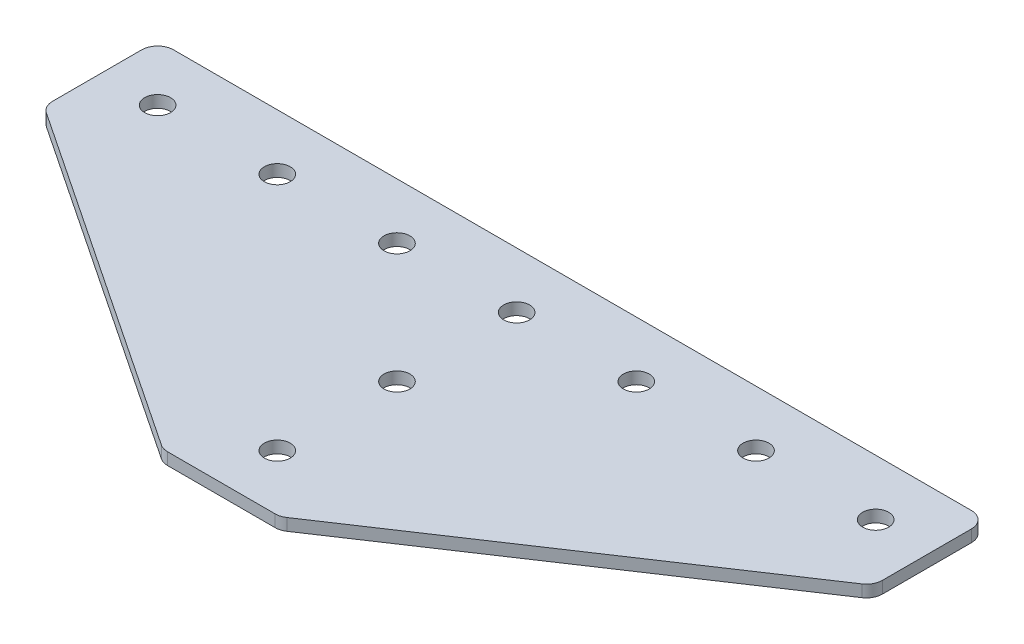
ISO-10303-21;
HEADER;
FILE_DESCRIPTION(('STEP AP214'),'2;1');
FILE_NAME('part.step','',(''),(''),'','','');
FILE_SCHEMA(('AUTOMOTIVE_DESIGN { 1 0 10303 214 1 1 1 1 }'));
ENDSEC;
DATA;
#1=APPLICATION_CONTEXT('core data for automotive mechanical design processes');
#2=APPLICATION_PROTOCOL_DEFINITION('international standard','automotive_design',2000,#1);
#3=PRODUCT_CONTEXT('',#1,'mechanical');
#4=PRODUCT('Part','Part','',(#3));
#5=PRODUCT_RELATED_PRODUCT_CATEGORY('part','',(#4));
#6=PRODUCT_DEFINITION_FORMATION('','',#4);
#7=PRODUCT_DEFINITION_CONTEXT('part definition',#1,'design');
#8=PRODUCT_DEFINITION('design','',#6,#7);
#9=PRODUCT_DEFINITION_SHAPE('','',#8);
#10=(LENGTH_UNIT() NAMED_UNIT(*) SI_UNIT(.MILLI.,.METRE.));
#11=(NAMED_UNIT(*) PLANE_ANGLE_UNIT() SI_UNIT($,.RADIAN.));
#12=(NAMED_UNIT(*) SI_UNIT($,.STERADIAN.) SOLID_ANGLE_UNIT());
#13=UNCERTAINTY_MEASURE_WITH_UNIT(LENGTH_MEASURE(1.E-05),#10,'distance_accuracy_value','');
#14=(GEOMETRIC_REPRESENTATION_CONTEXT(3) GLOBAL_UNCERTAINTY_ASSIGNED_CONTEXT((#13)) GLOBAL_UNIT_ASSIGNED_CONTEXT((#10,
#11,#12)) REPRESENTATION_CONTEXT('',''));
#15=CARTESIAN_POINT('',(0.,0.,0.));
#16=DIRECTION('',(0.,0.,1.));
#17=DIRECTION('',(1.,0.,0.));
#18=AXIS2_PLACEMENT_3D('',#15,#16,#17);
#19=CARTESIAN_POINT('',(-1.48251179552972,2.39126526075142,-16.6582429630034));
#20=DIRECTION('',(0.,-1.,0.));
#21=DIRECTION('',(0.,0.,-1.));
#22=AXIS2_PLACEMENT_3D('',#19,#20,#21);
#23=PLANE('',#22);
#24=CARTESIAN_POINT('',(-1.48251179552972,2.39126526075142,-16.6582429630034));
#25=DIRECTION('',(0.,1.,0.));
#26=DIRECTION('',(0.,0.,1.));
#27=AXIS2_PLACEMENT_3D('',#24,#25,#26);
#28=CIRCLE('',#27,1.625);
#29=CARTESIAN_POINT('',(-1.48251179552972,2.39126526075142,-15.0332429630034));
#30=VERTEX_POINT('',#29);
#31=EDGE_CURVE('E171',#30,#30,#28,.T.);
#32=ORIENTED_EDGE('',*,*,#31,.T.);
#33=EDGE_LOOP('',(#32));
#34=FACE_BOUND('',#33,.T.);
#35=DIRECTION('',(1.,0.,0.));
#36=VECTOR('',#35,1.);
#37=CARTESIAN_POINT('',(-8.48251179552981,2.39126526075142,20.3417570369966));
#38=LINE('',#37,#36);
#39=CARTESIAN_POINT('',(-8.22557270119984,2.39126526075142,20.3417570369966));
#40=VERTEX_POINT('',#39);
#41=CARTESIAN_POINT('',(5.26054911014039,2.39126526075142,20.3417570369966));
#42=VERTEX_POINT('',#41);
#43=EDGE_CURVE('E180',#40,#42,#38,.T.);
#44=ORIENTED_EDGE('',*,*,#43,.F.);
#45=CARTESIAN_POINT('',(-8.22557270119984,2.39126526075142,18.3417570369966));
#46=DIRECTION('',(0.,-1.,0.));
#47=DIRECTION('',(0.,0.,-1.));
#48=AXIS2_PLACEMENT_3D('',#45,#46,#47);
#49=CIRCLE('',#48,2.);
#50=CARTESIAN_POINT('',(-9.3349730936503,2.39126526075142,20.0058576256723));
#51=VERTEX_POINT('',#50);
#52=EDGE_CURVE('E224',#40,#51,#49,.T.);
#53=ORIENTED_EDGE('',*,*,#52,.T.);
#54=DIRECTION('',(-0.832050294337843,0.,-0.55470019622523));
#55=VECTOR('',#54,1.);
#56=CARTESIAN_POINT('',(-8.8311239766638,2.39126526075142,20.3417570369966));
#57=LINE('',#56,#55);
#58=CARTESIAN_POINT('',(-52.5919121879801,2.39126526075142,-8.83210177054765));
#59=VERTEX_POINT('',#58);
#60=EDGE_CURVE('E132',#51,#59,#57,.T.);
#61=ORIENTED_EDGE('',*,*,#60,.T.);
#62=CARTESIAN_POINT('',(-51.4825117955296,2.39126526075142,-10.4962023592233));
#63=DIRECTION('',(0.,-1.,0.));
#64=DIRECTION('',(0.,0.,-1.));
#65=AXIS2_PLACEMENT_3D('',#62,#63,#64);
#66=CIRCLE('',#65,2.);
#67=CARTESIAN_POINT('',(-53.4825117955296,2.39126526075142,-10.4962023592233));
#68=VERTEX_POINT('',#67);
#69=EDGE_CURVE('E198',#59,#68,#66,.T.);
#70=ORIENTED_EDGE('',*,*,#69,.T.);
#71=DIRECTION('',(0.,0.,-1.));
#72=VECTOR('',#71,1.);
#73=CARTESIAN_POINT('',(-53.4825117955296,2.39126526075142,-9.42583484224735));
#74=LINE('',#73,#72);
#75=CARTESIAN_POINT('',(-53.4825117955296,2.39126526075142,-21.6582429630034));
#76=VERTEX_POINT('',#75);
#77=EDGE_CURVE('E125',#68,#76,#74,.T.);
#78=ORIENTED_EDGE('',*,*,#77,.T.);
#79=CARTESIAN_POINT('',(-51.4825117955296,2.39126526075142,-21.6582429630034));
#80=DIRECTION('',(0.,-1.,0.));
#81=DIRECTION('',(0.,0.,-1.));
#82=AXIS2_PLACEMENT_3D('',#79,#80,#81);
#83=CIRCLE('',#82,2.);
#84=CARTESIAN_POINT('',(-51.4825117955296,2.39126526075142,-23.6582429630034));
#85=VERTEX_POINT('',#84);
#86=EDGE_CURVE('E217',#76,#85,#83,.T.);
#87=ORIENTED_EDGE('',*,*,#86,.T.);
#88=DIRECTION('',(-1.,0.,0.));
#89=VECTOR('',#88,1.);
#90=CARTESIAN_POINT('',(50.5174882044702,2.39126526075142,-23.6582429630034));
#91=LINE('',#90,#89);
#92=CARTESIAN_POINT('',(48.5174882044702,2.39126526075142,-23.6582429630034));
#93=VERTEX_POINT('',#92);
#94=EDGE_CURVE('E177',#93,#85,#91,.T.);
#95=ORIENTED_EDGE('',*,*,#94,.F.);
#96=CARTESIAN_POINT('',(48.5174882044702,2.39126526075142,-21.6582429630034));
#97=DIRECTION('',(0.,-1.,0.));
#98=DIRECTION('',(0.,0.,-1.));
#99=AXIS2_PLACEMENT_3D('',#96,#97,#98);
#100=CIRCLE('',#99,2.);
#101=CARTESIAN_POINT('',(50.5174882044702,2.39126526075142,-21.6582429630034));
#102=VERTEX_POINT('',#101);
#103=EDGE_CURVE('E219',#93,#102,#100,.T.);
#104=ORIENTED_EDGE('',*,*,#103,.T.);
#105=DIRECTION('',(0.,0.,-1.));
#106=VECTOR('',#105,1.);
#107=CARTESIAN_POINT('',(50.5174882044702,2.39126526075142,-9.42583484224737));
#108=LINE('',#107,#106);
#109=CARTESIAN_POINT('',(50.5174882044702,2.39126526075142,-10.4962023592234));
#110=VERTEX_POINT('',#109);
#111=EDGE_CURVE('E126',#110,#102,#108,.T.);
#112=ORIENTED_EDGE('',*,*,#111,.F.);
#113=CARTESIAN_POINT('',(48.5174882044702,2.39126526075142,-10.4962023592234));
#114=DIRECTION('',(0.,-1.,0.));
#115=DIRECTION('',(0.,0.,-1.));
#116=AXIS2_PLACEMENT_3D('',#113,#114,#115);
#117=CIRCLE('',#116,2.);
#118=CARTESIAN_POINT('',(49.6268885969206,2.39126526075142,-8.83210177054766));
#119=VERTEX_POINT('',#118);
#120=EDGE_CURVE('E31',#110,#119,#117,.T.);
#121=ORIENTED_EDGE('',*,*,#120,.T.);
#122=DIRECTION('',(0.832050294337843,0.,-0.55470019622523));
#123=VECTOR('',#122,1.);
#124=CARTESIAN_POINT('',(5.86610038560438,2.39126526075142,20.3417570369966));
#125=LINE('',#124,#123);
#126=CARTESIAN_POINT('',(6.36994950259085,2.39126526075142,20.0058576256723));
#127=VERTEX_POINT('',#126);
#128=EDGE_CURVE('E184',#127,#119,#125,.T.);
#129=ORIENTED_EDGE('',*,*,#128,.F.);
#130=CARTESIAN_POINT('',(5.26054911014039,2.39126526075142,18.3417570369966));
#131=DIRECTION('',(0.,-1.,0.));
#132=DIRECTION('',(0.,0.,-1.));
#133=AXIS2_PLACEMENT_3D('',#130,#131,#132);
#134=CIRCLE('',#133,2.);
#135=EDGE_CURVE('E222',#127,#42,#134,.T.);
#136=ORIENTED_EDGE('',*,*,#135,.T.);
#137=EDGE_LOOP('',(#44,#53,#61,#70,#78,#87,#95,#104,#112,#121,#129,#136));
#138=FACE_BOUND('',#137,.T.);
#139=CARTESIAN_POINT('',(-1.48251179552973,2.39126526075142,13.3417570369966));
#140=DIRECTION('',(0.,1.,0.));
#141=DIRECTION('',(0.,0.,1.));
#142=AXIS2_PLACEMENT_3D('',#139,#140,#141);
#143=CIRCLE('',#142,1.625);
#144=CARTESIAN_POINT('',(-1.48251179552973,2.39126526075142,14.9667570369966));
#145=VERTEX_POINT('',#144);
#146=EDGE_CURVE('E153',#145,#145,#143,.T.);
#147=ORIENTED_EDGE('',*,*,#146,.T.);
#148=EDGE_LOOP('',(#147));
#149=FACE_BOUND('',#148,.T.);
#150=CARTESIAN_POINT('',(-1.48251179552973,2.39126526075142,-1.6582429630034));
#151=DIRECTION('',(0.,1.,0.));
#152=DIRECTION('',(0.,0.,1.));
#153=AXIS2_PLACEMENT_3D('',#150,#151,#152);
#154=CIRCLE('',#153,1.625);
#155=CARTESIAN_POINT('',(-1.48251179552973,2.39126526075142,-0.0332429630033966));
#156=VERTEX_POINT('',#155);
#157=EDGE_CURVE('E159',#156,#156,#154,.T.);
#158=ORIENTED_EDGE('',*,*,#157,.T.);
#159=EDGE_LOOP('',(#158));
#160=FACE_BOUND('',#159,.T.);
#161=CARTESIAN_POINT('',(43.5174882044703,2.39126526075142,-16.6582429630034));
#162=DIRECTION('',(0.,1.,0.));
#163=DIRECTION('',(0.,0.,1.));
#164=AXIS2_PLACEMENT_3D('',#161,#162,#163);
#165=CIRCLE('',#164,1.625);
#166=CARTESIAN_POINT('',(43.5174882044703,2.39126526075142,-15.0332429630034));
#167=VERTEX_POINT('',#166);
#168=EDGE_CURVE('E140',#167,#167,#165,.T.);
#169=ORIENTED_EDGE('',*,*,#168,.T.);
#170=EDGE_LOOP('',(#169));
#171=FACE_BOUND('',#170,.T.);
#172=CARTESIAN_POINT('',(28.5174882044703,2.39126526075142,-16.6582429630034));
#173=DIRECTION('',(0.,1.,0.));
#174=DIRECTION('',(0.,0.,1.));
#175=AXIS2_PLACEMENT_3D('',#172,#173,#174);
#176=CIRCLE('',#175,1.625);
#177=CARTESIAN_POINT('',(28.5174882044703,2.39126526075142,-15.0332429630034));
#178=VERTEX_POINT('',#177);
#179=EDGE_CURVE('E147',#178,#178,#176,.T.);
#180=ORIENTED_EDGE('',*,*,#179,.T.);
#181=EDGE_LOOP('',(#180));
#182=FACE_BOUND('',#181,.T.);
#183=CARTESIAN_POINT('',(13.5174882044703,2.39126526075142,-16.6582429630034));
#184=DIRECTION('',(0.,1.,0.));
#185=DIRECTION('',(0.,0.,1.));
#186=AXIS2_PLACEMENT_3D('',#183,#184,#185);
#187=CIRCLE('',#186,1.625);
#188=CARTESIAN_POINT('',(13.5174882044703,2.39126526075142,-15.0332429630034));
#189=VERTEX_POINT('',#188);
#190=EDGE_CURVE('E165',#189,#189,#187,.T.);
#191=ORIENTED_EDGE('',*,*,#190,.T.);
#192=EDGE_LOOP('',(#191));
#193=FACE_BOUND('',#192,.T.);
#194=CARTESIAN_POINT('',(-46.4825117955297,2.39126526075142,-16.6582429630034));
#195=DIRECTION('',(0.,-1.,0.));
#196=DIRECTION('',(0.,0.,1.));
#197=AXIS2_PLACEMENT_3D('',#194,#195,#196);
#198=CIRCLE('',#197,1.625);
#199=CARTESIAN_POINT('',(-46.4825117955297,2.39126526075142,-15.0332429630034));
#200=VERTEX_POINT('',#199);
#201=EDGE_CURVE('E513',#200,#200,#198,.T.);
#202=ORIENTED_EDGE('',*,*,#201,.F.);
#203=EDGE_LOOP('',(#202));
#204=FACE_BOUND('',#203,.T.);
#205=CARTESIAN_POINT('',(-31.4825117955297,2.39126526075142,-16.6582429630034));
#206=DIRECTION('',(0.,-1.,0.));
#207=DIRECTION('',(0.,0.,1.));
#208=AXIS2_PLACEMENT_3D('',#205,#206,#207);
#209=CIRCLE('',#208,1.625);
#210=CARTESIAN_POINT('',(-31.4825117955297,2.39126526075142,-15.0332429630034));
#211=VERTEX_POINT('',#210);
#212=EDGE_CURVE('E506',#211,#211,#209,.T.);
#213=ORIENTED_EDGE('',*,*,#212,.F.);
#214=EDGE_LOOP('',(#213));
#215=FACE_BOUND('',#214,.T.);
#216=CARTESIAN_POINT('',(-16.4825117955297,2.39126526075142,-16.6582429630034));
#217=DIRECTION('',(0.,-1.,0.));
#218=DIRECTION('',(0.,0.,1.));
#219=AXIS2_PLACEMENT_3D('',#216,#217,#218);
#220=CIRCLE('',#219,1.625);
#221=CARTESIAN_POINT('',(-16.4825117955297,2.39126526075142,-15.0332429630034));
#222=VERTEX_POINT('',#221);
#223=EDGE_CURVE('E136',#222,#222,#220,.T.);
#224=ORIENTED_EDGE('',*,*,#223,.F.);
#225=EDGE_LOOP('',(#224));
#226=FACE_BOUND('',#225,.T.);
#227=ADVANCED_FACE('F16',(#34,#138,#149,#160,#171,#182,#193,#204,#215,#226),#23,.T.);
#228=CARTESIAN_POINT('',(50.5174882044702,2.39126526075142,-23.6582429630034));
#229=DIRECTION('',(0.,0.,-1.));
#230=DIRECTION('',(-1.,0.,0.));
#231=AXIS2_PLACEMENT_3D('',#228,#229,#230);
#232=PLANE('',#231);
#233=DIRECTION('',(-1.,0.,0.));
#234=VECTOR('',#233,1.);
#235=CARTESIAN_POINT('',(50.5174882044702,3.89126526075143,-23.6582429630034));
#236=LINE('',#235,#234);
#237=CARTESIAN_POINT('',(48.5174882044702,3.89126526075143,-23.6582429630034));
#238=VERTEX_POINT('',#237);
#239=CARTESIAN_POINT('',(-51.4825117955296,3.89126526075143,-23.6582429630034));
#240=VERTEX_POINT('',#239);
#241=EDGE_CURVE('E174',#238,#240,#236,.T.);
#242=ORIENTED_EDGE('',*,*,#241,.F.);
#243=DIRECTION('',(0.,1.,0.));
#244=VECTOR('',#243,1.);
#245=CARTESIAN_POINT('',(48.5174882044702,2.39126526075142,-23.6582429630034));
#246=LINE('',#245,#244);
#247=EDGE_CURVE('E24',#238,#93,#246,.F.);
#248=ORIENTED_EDGE('',*,*,#247,.T.);
#249=ORIENTED_EDGE('',*,*,#94,.T.);
#250=DIRECTION('',(0.,1.,0.));
#251=VECTOR('',#250,1.);
#252=CARTESIAN_POINT('',(-51.4825117955296,2.39126526075142,-23.6582429630034));
#253=LINE('',#252,#251);
#254=EDGE_CURVE('E235',#85,#240,#253,.T.);
#255=ORIENTED_EDGE('',*,*,#254,.T.);
#256=EDGE_LOOP('',(#242,#248,#249,#255));
#257=FACE_BOUND('',#256,.T.);
#258=ADVANCED_FACE('F241',(#257),#232,.T.);
#259=CARTESIAN_POINT('',(50.5174882044702,2.39126526075142,-9.42583484224737));
#260=DIRECTION('',(1.,0.,0.));
#261=DIRECTION('',(0.,0.,-1.));
#262=AXIS2_PLACEMENT_3D('',#259,#260,#261);
#263=PLANE('',#262);
#264=DIRECTION('',(0.,0.,-1.));
#265=VECTOR('',#264,1.);
#266=CARTESIAN_POINT('',(50.5174882044702,3.89126526075143,-9.42583484224737));
#267=LINE('',#266,#265);
#268=CARTESIAN_POINT('',(50.5174882044702,3.89126526075143,-10.4962023592234));
#269=VERTEX_POINT('',#268);
#270=CARTESIAN_POINT('',(50.5174882044702,3.89126526075143,-21.6582429630034));
#271=VERTEX_POINT('',#270);
#272=EDGE_CURVE('E181',#269,#271,#267,.T.);
#273=ORIENTED_EDGE('',*,*,#272,.F.);
#274=DIRECTION('',(0.,1.,0.));
#275=VECTOR('',#274,1.);
#276=CARTESIAN_POINT('',(50.5174882044702,2.39126526075142,-10.4962023592234));
#277=LINE('',#276,#275);
#278=EDGE_CURVE('E233',#269,#110,#277,.F.);
#279=ORIENTED_EDGE('',*,*,#278,.T.);
#280=ORIENTED_EDGE('',*,*,#111,.T.);
#281=DIRECTION('',(0.,1.,0.));
#282=VECTOR('',#281,1.);
#283=CARTESIAN_POINT('',(50.5174882044702,2.39126526075142,-21.6582429630034));
#284=LINE('',#283,#282);
#285=EDGE_CURVE('E230',#102,#271,#284,.T.);
#286=ORIENTED_EDGE('',*,*,#285,.T.);
#287=EDGE_LOOP('',(#273,#279,#280,#286));
#288=FACE_BOUND('',#287,.T.);
#289=ADVANCED_FACE('F252',(#288),#263,.T.);
#290=CARTESIAN_POINT('',(5.86610038560438,2.39126526075142,20.3417570369966));
#291=DIRECTION('',(0.55470019622523,0.,0.832050294337843));
#292=DIRECTION('',(0.832050294337843,0.,-0.55470019622523));
#293=AXIS2_PLACEMENT_3D('',#290,#291,#292);
#294=PLANE('',#293);
#295=DIRECTION('',(0.832050294337843,0.,-0.55470019622523));
#296=VECTOR('',#295,1.);
#297=CARTESIAN_POINT('',(5.86610038560438,3.89126526075143,20.3417570369966));
#298=LINE('',#297,#296);
#299=CARTESIAN_POINT('',(6.36994950259085,3.89126526075143,20.0058576256723));
#300=VERTEX_POINT('',#299);
#301=CARTESIAN_POINT('',(49.6268885969206,3.89126526075143,-8.83210177054766));
#302=VERTEX_POINT('',#301);
#303=EDGE_CURVE('E192',#300,#302,#298,.T.);
#304=ORIENTED_EDGE('',*,*,#303,.F.);
#305=DIRECTION('',(0.,1.,0.));
#306=VECTOR('',#305,1.);
#307=CARTESIAN_POINT('',(6.36994950259085,2.39126526075142,20.0058576256723));
#308=LINE('',#307,#306);
#309=EDGE_CURVE('E38',#300,#127,#308,.F.);
#310=ORIENTED_EDGE('',*,*,#309,.T.);
#311=ORIENTED_EDGE('',*,*,#128,.T.);
#312=DIRECTION('',(0.,1.,0.));
#313=VECTOR('',#312,1.);
#314=CARTESIAN_POINT('',(49.6268885969207,2.39126526075142,-8.83210177054767));
#315=LINE('',#314,#313);
#316=EDGE_CURVE('E226',#119,#302,#315,.T.);
#317=ORIENTED_EDGE('',*,*,#316,.T.);
#318=EDGE_LOOP('',(#304,#310,#311,#317));
#319=FACE_BOUND('',#318,.T.);
#320=ADVANCED_FACE('F257',(#319),#294,.T.);
#321=CARTESIAN_POINT('',(-8.48251179552981,2.39126526075142,20.3417570369966));
#322=DIRECTION('',(0.,0.,1.));
#323=DIRECTION('',(1.,0.,0.));
#324=AXIS2_PLACEMENT_3D('',#321,#322,#323);
#325=PLANE('',#324);
#326=DIRECTION('',(1.,0.,0.));
#327=VECTOR('',#326,1.);
#328=CARTESIAN_POINT('',(-8.48251179552981,3.89126526075143,20.3417570369966));
#329=LINE('',#328,#327);
#330=CARTESIAN_POINT('',(-8.22557270119984,3.89126526075143,20.3417570369966));
#331=VERTEX_POINT('',#330);
#332=CARTESIAN_POINT('',(5.26054911014039,3.89126526075143,20.3417570369966));
#333=VERTEX_POINT('',#332);
#334=EDGE_CURVE('E189',#331,#333,#329,.T.);
#335=ORIENTED_EDGE('',*,*,#334,.F.);
#336=DIRECTION('',(0.,1.,0.));
#337=VECTOR('',#336,1.);
#338=CARTESIAN_POINT('',(-8.22557270119984,2.39126526075142,20.3417570369966));
#339=LINE('',#338,#337);
#340=EDGE_CURVE('E215',#331,#40,#339,.F.);
#341=ORIENTED_EDGE('',*,*,#340,.T.);
#342=ORIENTED_EDGE('',*,*,#43,.T.);
#343=DIRECTION('',(0.,1.,0.));
#344=VECTOR('',#343,1.);
#345=CARTESIAN_POINT('',(5.26054911014039,2.39126526075142,20.3417570369966));
#346=LINE('',#345,#344);
#347=EDGE_CURVE('E212',#42,#333,#346,.T.);
#348=ORIENTED_EDGE('',*,*,#347,.T.);
#349=EDGE_LOOP('',(#335,#341,#342,#348));
#350=FACE_BOUND('',#349,.T.);
#351=ADVANCED_FACE('F264',(#350),#325,.T.);
#352=CARTESIAN_POINT('',(-1.48251179552972,3.89126526075143,-16.6582429630034));
#353=DIRECTION('',(0.,-1.,0.));
#354=DIRECTION('',(0.,0.,-1.));
#355=AXIS2_PLACEMENT_3D('',#352,#353,#354);
#356=PLANE('',#355);
#357=CARTESIAN_POINT('',(-1.48251179552972,3.89126526075143,-16.6582429630034));
#358=DIRECTION('',(0.,1.,0.));
#359=DIRECTION('',(0.,0.,1.));
#360=AXIS2_PLACEMENT_3D('',#357,#358,#359);
#361=CIRCLE('',#360,1.625);
#362=CARTESIAN_POINT('',(-1.48251179552972,3.89126526075143,-15.0332429630034));
#363=VERTEX_POINT('',#362);
#364=EDGE_CURVE('E168',#363,#363,#361,.T.);
#365=ORIENTED_EDGE('',*,*,#364,.F.);
#366=EDGE_LOOP('',(#365));
#367=FACE_BOUND('',#366,.T.);
#368=DIRECTION('',(-0.832050294337843,0.,-0.55470019622523));
#369=VECTOR('',#368,1.);
#370=CARTESIAN_POINT('',(-8.8311239766638,3.89126526075143,20.3417570369966));
#371=LINE('',#370,#369);
#372=CARTESIAN_POINT('',(-9.3349730936503,3.89126526075143,20.0058576256723));
#373=VERTEX_POINT('',#372);
#374=CARTESIAN_POINT('',(-52.5919121879801,3.89126526075143,-8.83210177054765));
#375=VERTEX_POINT('',#374);
#376=EDGE_CURVE('E133',#373,#375,#371,.T.);
#377=ORIENTED_EDGE('',*,*,#376,.F.);
#378=CARTESIAN_POINT('',(-8.22557270119984,3.89126526075143,18.3417570369966));
#379=DIRECTION('',(0.,-1.,0.));
#380=DIRECTION('',(0.,0.,-1.));
#381=AXIS2_PLACEMENT_3D('',#378,#379,#380);
#382=CIRCLE('',#381,2.);
#383=EDGE_CURVE('E210',#373,#331,#382,.F.);
#384=ORIENTED_EDGE('',*,*,#383,.T.);
#385=ORIENTED_EDGE('',*,*,#334,.T.);
#386=CARTESIAN_POINT('',(5.26054911014039,3.89126526075143,18.3417570369966));
#387=DIRECTION('',(0.,-1.,0.));
#388=DIRECTION('',(0.,0.,-1.));
#389=AXIS2_PLACEMENT_3D('',#386,#387,#388);
#390=CIRCLE('',#389,2.);
#391=EDGE_CURVE('E208',#333,#300,#390,.F.);
#392=ORIENTED_EDGE('',*,*,#391,.T.);
#393=ORIENTED_EDGE('',*,*,#303,.T.);
#394=CARTESIAN_POINT('',(48.5174882044702,3.89126526075143,-10.4962023592234));
#395=DIRECTION('',(0.,-1.,0.));
#396=DIRECTION('',(0.,0.,-1.));
#397=AXIS2_PLACEMENT_3D('',#394,#395,#396);
#398=CIRCLE('',#397,2.);
#399=EDGE_CURVE('E206',#302,#269,#398,.F.);
#400=ORIENTED_EDGE('',*,*,#399,.T.);
#401=ORIENTED_EDGE('',*,*,#272,.T.);
#402=CARTESIAN_POINT('',(48.5174882044702,3.89126526075143,-21.6582429630034));
#403=DIRECTION('',(0.,-1.,0.));
#404=DIRECTION('',(0.,0.,-1.));
#405=AXIS2_PLACEMENT_3D('',#402,#403,#404);
#406=CIRCLE('',#405,2.);
#407=EDGE_CURVE('E204',#271,#238,#406,.F.);
#408=ORIENTED_EDGE('',*,*,#407,.T.);
#409=ORIENTED_EDGE('',*,*,#241,.T.);
#410=CARTESIAN_POINT('',(-51.4825117955296,3.89126526075143,-21.6582429630034));
#411=DIRECTION('',(0.,-1.,0.));
#412=DIRECTION('',(0.,0.,-1.));
#413=AXIS2_PLACEMENT_3D('',#410,#411,#412);
#414=CIRCLE('',#413,2.);
#415=CARTESIAN_POINT('',(-53.4825117955296,3.89126526075143,-21.6582429630034));
#416=VERTEX_POINT('',#415);
#417=EDGE_CURVE('E131',#240,#416,#414,.F.);
#418=ORIENTED_EDGE('',*,*,#417,.T.);
#419=DIRECTION('',(0.,0.,-1.));
#420=VECTOR('',#419,1.);
#421=CARTESIAN_POINT('',(-53.4825117955296,3.89126526075143,-9.42583484224735));
#422=LINE('',#421,#420);
#423=CARTESIAN_POINT('',(-53.4825117955296,3.89126526075143,-10.4962023592233));
#424=VERTEX_POINT('',#423);
#425=EDGE_CURVE('E122',#424,#416,#422,.T.);
#426=ORIENTED_EDGE('',*,*,#425,.F.);
#427=CARTESIAN_POINT('',(-51.4825117955296,3.89126526075143,-10.4962023592233));
#428=DIRECTION('',(0.,-1.,0.));
#429=DIRECTION('',(0.,0.,-1.));
#430=AXIS2_PLACEMENT_3D('',#427,#428,#429);
#431=CIRCLE('',#430,2.);
#432=EDGE_CURVE('E107',#424,#375,#431,.F.);
#433=ORIENTED_EDGE('',*,*,#432,.T.);
#434=EDGE_LOOP('',(#377,#384,#385,#392,#393,#400,#401,#408,#409,#418,#426,#433));
#435=FACE_BOUND('',#434,.T.);
#436=CARTESIAN_POINT('',(-1.48251179552973,3.89126526075143,13.3417570369966));
#437=DIRECTION('',(0.,1.,0.));
#438=DIRECTION('',(0.,0.,1.));
#439=AXIS2_PLACEMENT_3D('',#436,#437,#438);
#440=CIRCLE('',#439,1.625);
#441=CARTESIAN_POINT('',(-1.48251179552973,3.89126526075143,14.9667570369966));
#442=VERTEX_POINT('',#441);
#443=EDGE_CURVE('E150',#442,#442,#440,.T.);
#444=ORIENTED_EDGE('',*,*,#443,.F.);
#445=EDGE_LOOP('',(#444));
#446=FACE_BOUND('',#445,.T.);
#447=CARTESIAN_POINT('',(43.5174882044703,3.89126526075143,-16.6582429630034));
#448=DIRECTION('',(0.,1.,0.));
#449=DIRECTION('',(0.,0.,1.));
#450=AXIS2_PLACEMENT_3D('',#447,#448,#449);
#451=CIRCLE('',#450,1.625);
#452=CARTESIAN_POINT('',(43.5174882044703,3.89126526075143,-15.0332429630034));
#453=VERTEX_POINT('',#452);
#454=EDGE_CURVE('E144',#453,#453,#451,.T.);
#455=ORIENTED_EDGE('',*,*,#454,.F.);
#456=EDGE_LOOP('',(#455));
#457=FACE_BOUND('',#456,.T.);
#458=CARTESIAN_POINT('',(28.5174882044703,3.89126526075143,-16.6582429630034));
#459=DIRECTION('',(0.,1.,0.));
#460=DIRECTION('',(0.,0.,1.));
#461=AXIS2_PLACEMENT_3D('',#458,#459,#460);
#462=CIRCLE('',#461,1.625);
#463=CARTESIAN_POINT('',(28.5174882044703,3.89126526075143,-15.0332429630034));
#464=VERTEX_POINT('',#463);
#465=EDGE_CURVE('E143',#464,#464,#462,.T.);
#466=ORIENTED_EDGE('',*,*,#465,.F.);
#467=EDGE_LOOP('',(#466));
#468=FACE_BOUND('',#467,.T.);
#469=CARTESIAN_POINT('',(13.5174882044703,3.89126526075143,-16.6582429630034));
#470=DIRECTION('',(0.,1.,0.));
#471=DIRECTION('',(0.,0.,1.));
#472=AXIS2_PLACEMENT_3D('',#469,#470,#471);
#473=CIRCLE('',#472,1.625);
#474=CARTESIAN_POINT('',(13.5174882044703,3.89126526075143,-15.0332429630034));
#475=VERTEX_POINT('',#474);
#476=EDGE_CURVE('E162',#475,#475,#473,.T.);
#477=ORIENTED_EDGE('',*,*,#476,.F.);
#478=EDGE_LOOP('',(#477));
#479=FACE_BOUND('',#478,.T.);
#480=CARTESIAN_POINT('',(-1.48251179552973,3.89126526075143,-1.6582429630034));
#481=DIRECTION('',(0.,1.,0.));
#482=DIRECTION('',(0.,0.,1.));
#483=AXIS2_PLACEMENT_3D('',#480,#481,#482);
#484=CIRCLE('',#483,1.625);
#485=CARTESIAN_POINT('',(-1.48251179552973,3.89126526075143,-0.0332429630033966));
#486=VERTEX_POINT('',#485);
#487=EDGE_CURVE('E156',#486,#486,#484,.T.);
#488=ORIENTED_EDGE('',*,*,#487,.F.);
#489=EDGE_LOOP('',(#488));
#490=FACE_BOUND('',#489,.T.);
#491=CARTESIAN_POINT('',(-46.4825117955297,3.89126526075143,-16.6582429630034));
#492=DIRECTION('',(0.,-1.,0.));
#493=DIRECTION('',(0.,0.,1.));
#494=AXIS2_PLACEMENT_3D('',#491,#492,#493);
#495=CIRCLE('',#494,1.625);
#496=CARTESIAN_POINT('',(-46.4825117955297,3.89126526075143,-15.0332429630034));
#497=VERTEX_POINT('',#496);
#498=EDGE_CURVE('E497',#497,#497,#495,.T.);
#499=ORIENTED_EDGE('',*,*,#498,.T.);
#500=EDGE_LOOP('',(#499));
#501=FACE_BOUND('',#500,.T.);
#502=CARTESIAN_POINT('',(-31.4825117955297,3.89126526075143,-16.6582429630034));
#503=DIRECTION('',(0.,-1.,0.));
#504=DIRECTION('',(0.,0.,1.));
#505=AXIS2_PLACEMENT_3D('',#502,#503,#504);
#506=CIRCLE('',#505,1.625);
#507=CARTESIAN_POINT('',(-31.4825117955297,3.89126526075143,-15.0332429630034));
#508=VERTEX_POINT('',#507);
#509=EDGE_CURVE('E501',#508,#508,#506,.T.);
#510=ORIENTED_EDGE('',*,*,#509,.T.);
#511=EDGE_LOOP('',(#510));
#512=FACE_BOUND('',#511,.T.);
#513=CARTESIAN_POINT('',(-16.4825117955297,3.89126526075143,-16.6582429630034));
#514=DIRECTION('',(0.,-1.,0.));
#515=DIRECTION('',(0.,0.,1.));
#516=AXIS2_PLACEMENT_3D('',#513,#514,#515);
#517=CIRCLE('',#516,1.625);
#518=CARTESIAN_POINT('',(-16.4825117955297,3.89126526075143,-15.0332429630034));
#519=VERTEX_POINT('',#518);
#520=EDGE_CURVE('E504',#519,#519,#517,.T.);
#521=ORIENTED_EDGE('',*,*,#520,.T.);
#522=EDGE_LOOP('',(#521));
#523=FACE_BOUND('',#522,.T.);
#524=ADVANCED_FACE('F128',(#367,#435,#446,#457,#468,#479,#490,#501,#512,#523),#356,.F.);
#525=CARTESIAN_POINT('',(-1.48251179552972,2.39126526075142,-16.6582429630034));
#526=DIRECTION('',(0.,1.,0.));
#527=DIRECTION('',(0.,0.,1.));
#528=AXIS2_PLACEMENT_3D('',#525,#526,#527);
#529=CYLINDRICAL_SURFACE('',#528,1.625);
#530=ORIENTED_EDGE('',*,*,#31,.F.);
#531=EDGE_LOOP('',(#530));
#532=FACE_BOUND('',#531,.T.);
#533=ORIENTED_EDGE('',*,*,#364,.T.);
#534=EDGE_LOOP('',(#533));
#535=FACE_BOUND('',#534,.T.);
#536=ADVANCED_FACE('F418',(#532,#535),#529,.F.);
#537=CARTESIAN_POINT('',(13.5174882044703,2.39126526075142,-16.6582429630034));
#538=DIRECTION('',(0.,1.,0.));
#539=DIRECTION('',(0.,0.,1.));
#540=AXIS2_PLACEMENT_3D('',#537,#538,#539);
#541=CYLINDRICAL_SURFACE('',#540,1.625);
#542=ORIENTED_EDGE('',*,*,#190,.F.);
#543=EDGE_LOOP('',(#542));
#544=FACE_BOUND('',#543,.T.);
#545=ORIENTED_EDGE('',*,*,#476,.T.);
#546=EDGE_LOOP('',(#545));
#547=FACE_BOUND('',#546,.T.);
#548=ADVANCED_FACE('F409',(#544,#547),#541,.F.);
#549=CARTESIAN_POINT('',(-1.48251179552973,2.39126526075142,-1.6582429630034));
#550=DIRECTION('',(0.,1.,0.));
#551=DIRECTION('',(0.,0.,1.));
#552=AXIS2_PLACEMENT_3D('',#549,#550,#551);
#553=CYLINDRICAL_SURFACE('',#552,1.625);
#554=ORIENTED_EDGE('',*,*,#487,.T.);
#555=EDGE_LOOP('',(#554));
#556=FACE_BOUND('',#555,.T.);
#557=ORIENTED_EDGE('',*,*,#157,.F.);
#558=EDGE_LOOP('',(#557));
#559=FACE_BOUND('',#558,.T.);
#560=ADVANCED_FACE('F400',(#556,#559),#553,.F.);
#561=CARTESIAN_POINT('',(-1.48251179552973,2.39126526075142,13.3417570369966));
#562=DIRECTION('',(0.,1.,0.));
#563=DIRECTION('',(0.,0.,1.));
#564=AXIS2_PLACEMENT_3D('',#561,#562,#563);
#565=CYLINDRICAL_SURFACE('',#564,1.625);
#566=ORIENTED_EDGE('',*,*,#443,.T.);
#567=EDGE_LOOP('',(#566));
#568=FACE_BOUND('',#567,.T.);
#569=ORIENTED_EDGE('',*,*,#146,.F.);
#570=EDGE_LOOP('',(#569));
#571=FACE_BOUND('',#570,.T.);
#572=ADVANCED_FACE('F391',(#568,#571),#565,.F.);
#573=CARTESIAN_POINT('',(28.5174882044703,2.39126526075142,-16.6582429630034));
#574=DIRECTION('',(0.,1.,0.));
#575=DIRECTION('',(0.,0.,1.));
#576=AXIS2_PLACEMENT_3D('',#573,#574,#575);
#577=CYLINDRICAL_SURFACE('',#576,1.625);
#578=ORIENTED_EDGE('',*,*,#179,.F.);
#579=EDGE_LOOP('',(#578));
#580=FACE_BOUND('',#579,.T.);
#581=ORIENTED_EDGE('',*,*,#465,.T.);
#582=EDGE_LOOP('',(#581));
#583=FACE_BOUND('',#582,.T.);
#584=ADVANCED_FACE('F382',(#580,#583),#577,.F.);
#585=CARTESIAN_POINT('',(43.5174882044703,2.39126526075142,-16.6582429630034));
#586=DIRECTION('',(0.,1.,0.));
#587=DIRECTION('',(0.,0.,1.));
#588=AXIS2_PLACEMENT_3D('',#585,#586,#587);
#589=CYLINDRICAL_SURFACE('',#588,1.625);
#590=ORIENTED_EDGE('',*,*,#168,.F.);
#591=EDGE_LOOP('',(#590));
#592=FACE_BOUND('',#591,.T.);
#593=ORIENTED_EDGE('',*,*,#454,.T.);
#594=EDGE_LOOP('',(#593));
#595=FACE_BOUND('',#594,.T.);
#596=ADVANCED_FACE('F374',(#592,#595),#589,.F.);
#597=CARTESIAN_POINT('',(-53.4825117955296,2.39126526075142,-9.42583484224735));
#598=DIRECTION('',(-1.,0.,0.));
#599=DIRECTION('',(0.,0.,-1.));
#600=AXIS2_PLACEMENT_3D('',#597,#598,#599);
#601=PLANE('',#600);
#602=ORIENTED_EDGE('',*,*,#425,.T.);
#603=DIRECTION('',(0.,1.,0.));
#604=VECTOR('',#603,1.);
#605=CARTESIAN_POINT('',(-53.4825117955296,2.39126526075142,-21.6582429630034));
#606=LINE('',#605,#604);
#607=EDGE_CURVE('E10',#416,#76,#606,.F.);
#608=ORIENTED_EDGE('',*,*,#607,.T.);
#609=ORIENTED_EDGE('',*,*,#77,.F.);
#610=DIRECTION('',(0.,1.,0.));
#611=VECTOR('',#610,1.);
#612=CARTESIAN_POINT('',(-53.4825117955296,2.39126526075142,-10.4962023592233));
#613=LINE('',#612,#611);
#614=EDGE_CURVE('E111',#68,#424,#613,.T.);
#615=ORIENTED_EDGE('',*,*,#614,.T.);
#616=EDGE_LOOP('',(#602,#608,#609,#615));
#617=FACE_BOUND('',#616,.T.);
#618=ADVANCED_FACE('F121',(#617),#601,.T.);
#619=CARTESIAN_POINT('',(-8.8311239766638,2.39126526075142,20.3417570369966));
#620=DIRECTION('',(-0.55470019622523,0.,0.832050294337843));
#621=DIRECTION('',(-0.832050294337843,0.,-0.55470019622523));
#622=AXIS2_PLACEMENT_3D('',#619,#620,#621);
#623=PLANE('',#622);
#624=ORIENTED_EDGE('',*,*,#60,.F.);
#625=DIRECTION('',(0.,1.,0.));
#626=VECTOR('',#625,1.);
#627=CARTESIAN_POINT('',(-9.3349730936503,2.39126526075142,20.0058576256723));
#628=LINE('',#627,#626);
#629=EDGE_CURVE('E200',#51,#373,#628,.T.);
#630=ORIENTED_EDGE('',*,*,#629,.T.);
#631=ORIENTED_EDGE('',*,*,#376,.T.);
#632=DIRECTION('',(0.,1.,0.));
#633=VECTOR('',#632,1.);
#634=CARTESIAN_POINT('',(-52.5919121879801,2.39126526075142,-8.83210177054766));
#635=LINE('',#634,#633);
#636=EDGE_CURVE('E113',#375,#59,#635,.F.);
#637=ORIENTED_EDGE('',*,*,#636,.T.);
#638=EDGE_LOOP('',(#624,#630,#631,#637));
#639=FACE_BOUND('',#638,.T.);
#640=ADVANCED_FACE('F272',(#639),#623,.T.);
#641=CARTESIAN_POINT('',(-16.4825117955297,2.39126526075142,-16.6582429630034));
#642=DIRECTION('',(0.,1.,0.));
#643=DIRECTION('',(0.,0.,1.));
#644=AXIS2_PLACEMENT_3D('',#641,#642,#643);
#645=CYLINDRICAL_SURFACE('',#644,1.625);
#646=ORIENTED_EDGE('',*,*,#223,.T.);
#647=EDGE_LOOP('',(#646));
#648=FACE_BOUND('',#647,.T.);
#649=ORIENTED_EDGE('',*,*,#520,.F.);
#650=EDGE_LOOP('',(#649));
#651=FACE_BOUND('',#650,.T.);
#652=ADVANCED_FACE('F350',(#648,#651),#645,.F.);
#653=CARTESIAN_POINT('',(-31.4825117955297,2.39126526075142,-16.6582429630034));
#654=DIRECTION('',(0.,1.,0.));
#655=DIRECTION('',(0.,0.,1.));
#656=AXIS2_PLACEMENT_3D('',#653,#654,#655);
#657=CYLINDRICAL_SURFACE('',#656,1.625);
#658=ORIENTED_EDGE('',*,*,#212,.T.);
#659=EDGE_LOOP('',(#658));
#660=FACE_BOUND('',#659,.T.);
#661=ORIENTED_EDGE('',*,*,#509,.F.);
#662=EDGE_LOOP('',(#661));
#663=FACE_BOUND('',#662,.T.);
#664=ADVANCED_FACE('F341',(#660,#663),#657,.F.);
#665=CARTESIAN_POINT('',(-46.4825117955297,2.39126526075142,-16.6582429630034));
#666=DIRECTION('',(0.,1.,0.));
#667=DIRECTION('',(0.,0.,1.));
#668=AXIS2_PLACEMENT_3D('',#665,#666,#667);
#669=CYLINDRICAL_SURFACE('',#668,1.625);
#670=ORIENTED_EDGE('',*,*,#201,.T.);
#671=EDGE_LOOP('',(#670));
#672=FACE_BOUND('',#671,.T.);
#673=ORIENTED_EDGE('',*,*,#498,.F.);
#674=EDGE_LOOP('',(#673));
#675=FACE_BOUND('',#674,.T.);
#676=ADVANCED_FACE('F290',(#672,#675),#669,.F.);
#677=CARTESIAN_POINT('',(-51.4825117955296,2.39126526075142,-10.4962023592233));
#678=DIRECTION('',(0.,1.,0.));
#679=DIRECTION('',(0.,0.,1.));
#680=AXIS2_PLACEMENT_3D('',#677,#678,#679);
#681=CYLINDRICAL_SURFACE('',#680,2.);
#682=ORIENTED_EDGE('',*,*,#69,.F.);
#683=ORIENTED_EDGE('',*,*,#636,.F.);
#684=ORIENTED_EDGE('',*,*,#432,.F.);
#685=ORIENTED_EDGE('',*,*,#614,.F.);
#686=EDGE_LOOP('',(#682,#683,#684,#685));
#687=FACE_BOUND('',#686,.T.);
#688=ADVANCED_FACE('F110',(#687),#681,.T.);
#689=CARTESIAN_POINT('',(-8.22557270119984,2.39126526075142,18.3417570369966));
#690=DIRECTION('',(0.,1.,0.));
#691=DIRECTION('',(0.,0.,1.));
#692=AXIS2_PLACEMENT_3D('',#689,#690,#691);
#693=CYLINDRICAL_SURFACE('',#692,2.);
#694=ORIENTED_EDGE('',*,*,#52,.F.);
#695=ORIENTED_EDGE('',*,*,#340,.F.);
#696=ORIENTED_EDGE('',*,*,#383,.F.);
#697=ORIENTED_EDGE('',*,*,#629,.F.);
#698=EDGE_LOOP('',(#694,#695,#696,#697));
#699=FACE_BOUND('',#698,.T.);
#700=ADVANCED_FACE('F269',(#699),#693,.T.);
#701=CARTESIAN_POINT('',(5.26054911014039,2.39126526075142,18.3417570369966));
#702=DIRECTION('',(0.,1.,0.));
#703=DIRECTION('',(0.,0.,1.));
#704=AXIS2_PLACEMENT_3D('',#701,#702,#703);
#705=CYLINDRICAL_SURFACE('',#704,2.);
#706=ORIENTED_EDGE('',*,*,#135,.F.);
#707=ORIENTED_EDGE('',*,*,#309,.F.);
#708=ORIENTED_EDGE('',*,*,#391,.F.);
#709=ORIENTED_EDGE('',*,*,#347,.F.);
#710=EDGE_LOOP('',(#706,#707,#708,#709));
#711=FACE_BOUND('',#710,.T.);
#712=ADVANCED_FACE('F261',(#711),#705,.T.);
#713=CARTESIAN_POINT('',(48.5174882044702,2.39126526075142,-10.4962023592234));
#714=DIRECTION('',(0.,1.,0.));
#715=DIRECTION('',(0.,0.,1.));
#716=AXIS2_PLACEMENT_3D('',#713,#714,#715);
#717=CYLINDRICAL_SURFACE('',#716,2.);
#718=ORIENTED_EDGE('',*,*,#120,.F.);
#719=ORIENTED_EDGE('',*,*,#278,.F.);
#720=ORIENTED_EDGE('',*,*,#399,.F.);
#721=ORIENTED_EDGE('',*,*,#316,.F.);
#722=EDGE_LOOP('',(#718,#719,#720,#721));
#723=FACE_BOUND('',#722,.T.);
#724=ADVANCED_FACE('F256',(#723),#717,.T.);
#725=CARTESIAN_POINT('',(48.5174882044702,2.39126526075142,-21.6582429630034));
#726=DIRECTION('',(0.,1.,0.));
#727=DIRECTION('',(0.,0.,1.));
#728=AXIS2_PLACEMENT_3D('',#725,#726,#727);
#729=CYLINDRICAL_SURFACE('',#728,2.);
#730=ORIENTED_EDGE('',*,*,#103,.F.);
#731=ORIENTED_EDGE('',*,*,#247,.F.);
#732=ORIENTED_EDGE('',*,*,#407,.F.);
#733=ORIENTED_EDGE('',*,*,#285,.F.);
#734=EDGE_LOOP('',(#730,#731,#732,#733));
#735=FACE_BOUND('',#734,.T.);
#736=ADVANCED_FACE('F249',(#735),#729,.T.);
#737=CARTESIAN_POINT('',(-51.4825117955296,2.39126526075142,-21.6582429630034));
#738=DIRECTION('',(0.,1.,0.));
#739=DIRECTION('',(0.,0.,1.));
#740=AXIS2_PLACEMENT_3D('',#737,#738,#739);
#741=CYLINDRICAL_SURFACE('',#740,2.);
#742=ORIENTED_EDGE('',*,*,#86,.F.);
#743=ORIENTED_EDGE('',*,*,#607,.F.);
#744=ORIENTED_EDGE('',*,*,#417,.F.);
#745=ORIENTED_EDGE('',*,*,#254,.F.);
#746=EDGE_LOOP('',(#742,#743,#744,#745));
#747=FACE_BOUND('',#746,.T.);
#748=ADVANCED_FACE('F18',(#747),#741,.T.);
#749=CLOSED_SHELL('',(#227,#258,#289,#320,#351,#524,#536,#548,#560,#572,#584,#596,#618,#640,
#652,#664,#676,#688,#700,#712,#724,#736,#748));
#750=MANIFOLD_SOLID_BREP('B1',#749);
#751=ADVANCED_BREP_SHAPE_REPRESENTATION('',(#18,#750),#14);
#752=SHAPE_DEFINITION_REPRESENTATION(#9,#751);
ENDSEC;
END-ISO-10303-21;
